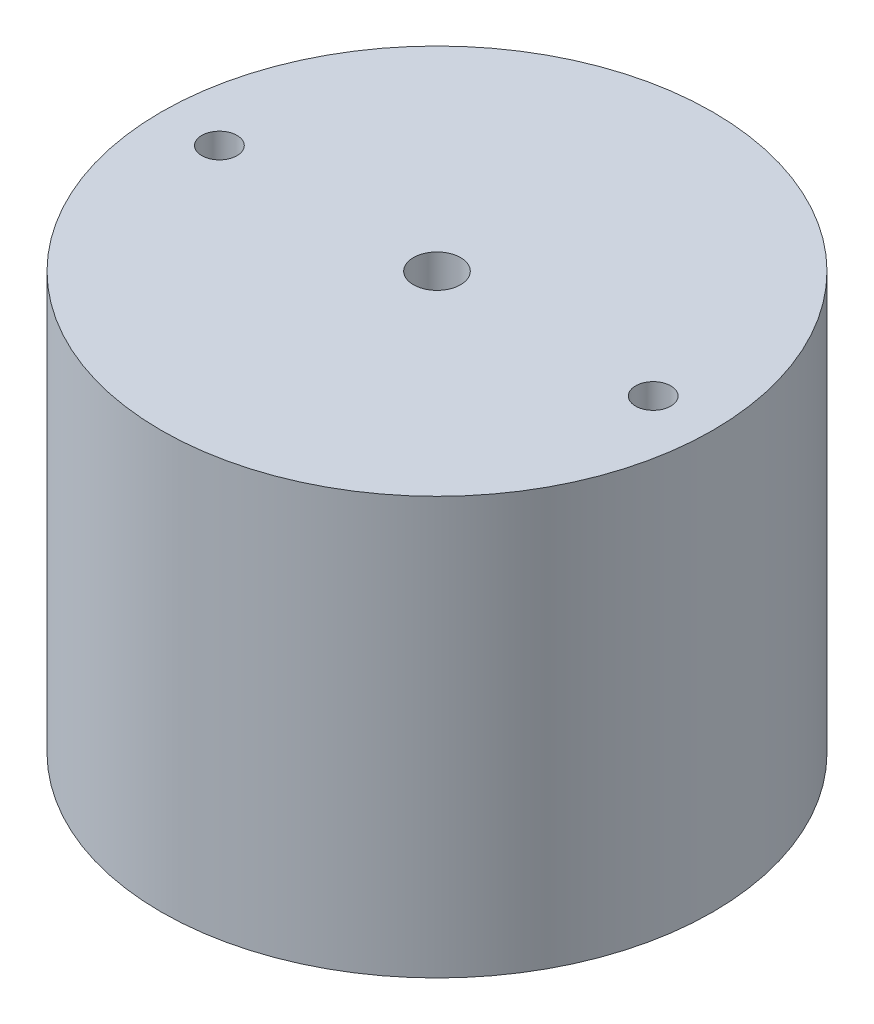
ISO-10303-21;
HEADER;
FILE_DESCRIPTION(('STEP AP214'),'2;1');
FILE_NAME('part.step','',(''),(''),'','','');
FILE_SCHEMA(('AUTOMOTIVE_DESIGN { 1 0 10303 214 1 1 1 1 }'));
ENDSEC;
DATA;
#1=APPLICATION_CONTEXT('core data for automotive mechanical design processes');
#2=APPLICATION_PROTOCOL_DEFINITION('international standard','automotive_design',2000,#1);
#3=PRODUCT_CONTEXT('',#1,'mechanical');
#4=PRODUCT('Part','Part','',(#3));
#5=PRODUCT_RELATED_PRODUCT_CATEGORY('part','',(#4));
#6=PRODUCT_DEFINITION_FORMATION('','',#4);
#7=PRODUCT_DEFINITION_CONTEXT('part definition',#1,'design');
#8=PRODUCT_DEFINITION('design','',#6,#7);
#9=PRODUCT_DEFINITION_SHAPE('','',#8);
#10=(LENGTH_UNIT() NAMED_UNIT(*) SI_UNIT(.MILLI.,.METRE.));
#11=(NAMED_UNIT(*) PLANE_ANGLE_UNIT() SI_UNIT($,.RADIAN.));
#12=(NAMED_UNIT(*) SI_UNIT($,.STERADIAN.) SOLID_ANGLE_UNIT());
#13=UNCERTAINTY_MEASURE_WITH_UNIT(LENGTH_MEASURE(1.E-05),#10,'distance_accuracy_value','');
#14=(GEOMETRIC_REPRESENTATION_CONTEXT(3) GLOBAL_UNCERTAINTY_ASSIGNED_CONTEXT((#13)) GLOBAL_UNIT_ASSIGNED_CONTEXT((#10,
#11,#12)) REPRESENTATION_CONTEXT('',''));
#15=CARTESIAN_POINT('',(0.,0.,0.));
#16=DIRECTION('',(0.,0.,1.));
#17=DIRECTION('',(1.,0.,0.));
#18=AXIS2_PLACEMENT_3D('',#15,#16,#17);
#19=CARTESIAN_POINT('',(0.,57.15,0.));
#20=DIRECTION('',(0.,1.,0.));
#21=DIRECTION('',(0.,0.,1.));
#22=AXIS2_PLACEMENT_3D('',#19,#20,#21);
#23=PLANE('',#22);
#24=CARTESIAN_POINT('',(-59.6281133752367,57.15,0.));
#25=DIRECTION('',(0.,1.,0.));
#26=DIRECTION('',(0.,0.,1.));
#27=AXIS2_PLACEMENT_3D('',#24,#25,#26);
#28=CIRCLE('',#27,4.82599999999999);
#29=CARTESIAN_POINT('',(-59.6281133752367,57.15,4.82599999999999));
#30=VERTEX_POINT('',#29);
#31=EDGE_CURVE('E55',#30,#30,#28,.T.);
#32=ORIENTED_EDGE('',*,*,#31,.F.);
#33=EDGE_LOOP('',(#32));
#34=FACE_BOUND('',#33,.T.);
#35=CARTESIAN_POINT('',(0.,57.15,0.));
#36=DIRECTION('',(0.,1.,0.));
#37=DIRECTION('',(0.,0.,1.));
#38=AXIS2_PLACEMENT_3D('',#35,#36,#37);
#39=CIRCLE('',#38,75.565);
#40=CARTESIAN_POINT('',(0.,57.15,75.565));
#41=VERTEX_POINT('',#40);
#42=EDGE_CURVE('E10',#41,#41,#39,.T.);
#43=ORIENTED_EDGE('',*,*,#42,.T.);
#44=EDGE_LOOP('',(#43));
#45=FACE_BOUND('',#44,.T.);
#46=CARTESIAN_POINT('',(0.,57.15,0.));
#47=DIRECTION('',(0.,1.,0.));
#48=DIRECTION('',(0.,0.,1.));
#49=AXIS2_PLACEMENT_3D('',#46,#47,#48);
#50=CIRCLE('',#49,6.4604347826087);
#51=CARTESIAN_POINT('',(0.,57.15,6.4604347826087));
#52=VERTEX_POINT('',#51);
#53=EDGE_CURVE('E50',#52,#52,#50,.T.);
#54=ORIENTED_EDGE('',*,*,#53,.F.);
#55=EDGE_LOOP('',(#54));
#56=FACE_BOUND('',#55,.T.);
#57=CARTESIAN_POINT('',(59.2438866247633,57.15,0.));
#58=DIRECTION('',(0.,1.,0.));
#59=DIRECTION('',(0.,0.,1.));
#60=AXIS2_PLACEMENT_3D('',#57,#58,#59);
#61=CIRCLE('',#60,4.82599999999999);
#62=CARTESIAN_POINT('',(59.2438866247633,57.15,4.82599999999999));
#63=VERTEX_POINT('',#62);
#64=EDGE_CURVE('E61',#63,#63,#61,.T.);
#65=ORIENTED_EDGE('',*,*,#64,.F.);
#66=EDGE_LOOP('',(#65));
#67=FACE_BOUND('',#66,.T.);
#68=ADVANCED_FACE('F39',(#34,#45,#56,#67),#23,.T.);
#69=CARTESIAN_POINT('',(0.,-57.15,0.));
#70=DIRECTION('',(0.,1.,0.));
#71=DIRECTION('',(0.,0.,1.));
#72=AXIS2_PLACEMENT_3D('',#69,#70,#71);
#73=PLANE('',#72);
#74=CARTESIAN_POINT('',(0.,-57.15,0.));
#75=DIRECTION('',(0.,1.,0.));
#76=DIRECTION('',(0.,0.,1.));
#77=AXIS2_PLACEMENT_3D('',#74,#75,#76);
#78=CIRCLE('',#77,75.565);
#79=CARTESIAN_POINT('',(0.,-57.15,75.565));
#80=VERTEX_POINT('',#79);
#81=EDGE_CURVE('E43',#80,#80,#78,.T.);
#82=ORIENTED_EDGE('',*,*,#81,.F.);
#83=EDGE_LOOP('',(#82));
#84=FACE_BOUND('',#83,.T.);
#85=CARTESIAN_POINT('',(0.,-57.15,0.));
#86=DIRECTION('',(0.,1.,0.));
#87=DIRECTION('',(0.,0.,1.));
#88=AXIS2_PLACEMENT_3D('',#85,#86,#87);
#89=CIRCLE('',#88,6.4604347826087);
#90=CARTESIAN_POINT('',(0.,-57.15,6.4604347826087));
#91=VERTEX_POINT('',#90);
#92=EDGE_CURVE('E52',#91,#91,#89,.T.);
#93=ORIENTED_EDGE('',*,*,#92,.T.);
#94=EDGE_LOOP('',(#93));
#95=FACE_BOUND('',#94,.T.);
#96=CARTESIAN_POINT('',(-59.6281133752367,-57.15,0.));
#97=DIRECTION('',(0.,1.,0.));
#98=DIRECTION('',(0.,0.,1.));
#99=AXIS2_PLACEMENT_3D('',#96,#97,#98);
#100=CIRCLE('',#99,4.82599999999999);
#101=CARTESIAN_POINT('',(-59.6281133752367,-57.15,4.82599999999999));
#102=VERTEX_POINT('',#101);
#103=EDGE_CURVE('E58',#102,#102,#100,.T.);
#104=ORIENTED_EDGE('',*,*,#103,.T.);
#105=EDGE_LOOP('',(#104));
#106=FACE_BOUND('',#105,.T.);
#107=CARTESIAN_POINT('',(59.2438866247633,-57.15,0.));
#108=DIRECTION('',(0.,1.,0.));
#109=DIRECTION('',(0.,0.,1.));
#110=AXIS2_PLACEMENT_3D('',#107,#108,#109);
#111=CIRCLE('',#110,4.82599999999999);
#112=CARTESIAN_POINT('',(59.2438866247633,-57.15,4.82599999999999));
#113=VERTEX_POINT('',#112);
#114=EDGE_CURVE('E64',#113,#113,#111,.T.);
#115=ORIENTED_EDGE('',*,*,#114,.T.);
#116=EDGE_LOOP('',(#115));
#117=FACE_BOUND('',#116,.T.);
#118=ADVANCED_FACE('F74',(#84,#95,#106,#117),#73,.F.);
#119=CARTESIAN_POINT('',(0.,57.15,0.));
#120=DIRECTION('',(0.,-1.,0.));
#121=DIRECTION('',(0.,0.,-1.));
#122=AXIS2_PLACEMENT_3D('',#119,#120,#121);
#123=CYLINDRICAL_SURFACE('',#122,75.565);
#124=ORIENTED_EDGE('',*,*,#42,.F.);
#125=EDGE_LOOP('',(#124));
#126=FACE_BOUND('',#125,.T.);
#127=ORIENTED_EDGE('',*,*,#81,.T.);
#128=EDGE_LOOP('',(#127));
#129=FACE_BOUND('',#128,.T.);
#130=ADVANCED_FACE('F41',(#126,#129),#123,.T.);
#131=CARTESIAN_POINT('',(0.,57.15,0.));
#132=DIRECTION('',(0.,-1.,0.));
#133=DIRECTION('',(0.,0.,-1.));
#134=AXIS2_PLACEMENT_3D('',#131,#132,#133);
#135=CYLINDRICAL_SURFACE('',#134,6.4604347826087);
#136=ORIENTED_EDGE('',*,*,#53,.T.);
#137=EDGE_LOOP('',(#136));
#138=FACE_BOUND('',#137,.T.);
#139=ORIENTED_EDGE('',*,*,#92,.F.);
#140=EDGE_LOOP('',(#139));
#141=FACE_BOUND('',#140,.T.);
#142=ADVANCED_FACE('F83',(#138,#141),#135,.F.);
#143=CARTESIAN_POINT('',(-59.6281133752367,57.15,0.));
#144=DIRECTION('',(0.,-1.,0.));
#145=DIRECTION('',(0.,0.,-1.));
#146=AXIS2_PLACEMENT_3D('',#143,#144,#145);
#147=CYLINDRICAL_SURFACE('',#146,4.82599999999999);
#148=ORIENTED_EDGE('',*,*,#31,.T.);
#149=EDGE_LOOP('',(#148));
#150=FACE_BOUND('',#149,.T.);
#151=ORIENTED_EDGE('',*,*,#103,.F.);
#152=EDGE_LOOP('',(#151));
#153=FACE_BOUND('',#152,.T.);
#154=ADVANCED_FACE('F86',(#150,#153),#147,.F.);
#155=CARTESIAN_POINT('',(59.2438866247633,57.15,0.));
#156=DIRECTION('',(0.,-1.,0.));
#157=DIRECTION('',(0.,0.,-1.));
#158=AXIS2_PLACEMENT_3D('',#155,#156,#157);
#159=CYLINDRICAL_SURFACE('',#158,4.82599999999999);
#160=ORIENTED_EDGE('',*,*,#64,.T.);
#161=EDGE_LOOP('',(#160));
#162=FACE_BOUND('',#161,.T.);
#163=ORIENTED_EDGE('',*,*,#114,.F.);
#164=EDGE_LOOP('',(#163));
#165=FACE_BOUND('',#164,.T.);
#166=ADVANCED_FACE('F70',(#162,#165),#159,.F.);
#167=CLOSED_SHELL('',(#68,#118,#130,#142,#154,#166));
#168=MANIFOLD_SOLID_BREP('B2',#167);
#169=ADVANCED_BREP_SHAPE_REPRESENTATION('',(#18,#168),#14);
#170=SHAPE_DEFINITION_REPRESENTATION(#9,#169);
ENDSEC;
END-ISO-10303-21;
